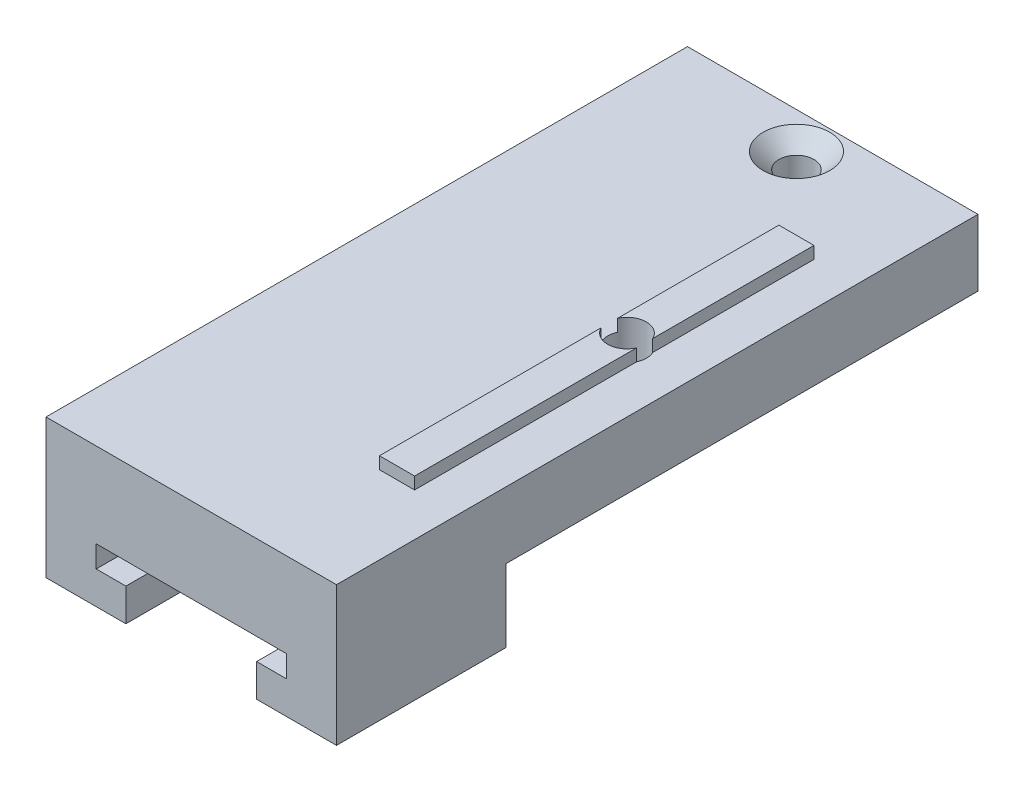
ISO-10303-21;
HEADER;
FILE_DESCRIPTION(('STEP AP214'),'2;1');
FILE_NAME('part.step','',(''),(''),'','','');
FILE_SCHEMA(('AUTOMOTIVE_DESIGN { 1 0 10303 214 1 1 1 1 }'));
ENDSEC;
DATA;
#1=APPLICATION_CONTEXT('core data for automotive mechanical design processes');
#2=APPLICATION_PROTOCOL_DEFINITION('international standard','automotive_design',2000,#1);
#3=PRODUCT_CONTEXT('',#1,'mechanical');
#4=PRODUCT('Part','Part','',(#3));
#5=PRODUCT_RELATED_PRODUCT_CATEGORY('part','',(#4));
#6=PRODUCT_DEFINITION_FORMATION('','',#4);
#7=PRODUCT_DEFINITION_CONTEXT('part definition',#1,'design');
#8=PRODUCT_DEFINITION('design','',#6,#7);
#9=PRODUCT_DEFINITION_SHAPE('','',#8);
#10=(LENGTH_UNIT() NAMED_UNIT(*) SI_UNIT(.MILLI.,.METRE.));
#11=(NAMED_UNIT(*) PLANE_ANGLE_UNIT() SI_UNIT($,.RADIAN.));
#12=(NAMED_UNIT(*) SI_UNIT($,.STERADIAN.) SOLID_ANGLE_UNIT());
#13=UNCERTAINTY_MEASURE_WITH_UNIT(LENGTH_MEASURE(1.E-05),#10,'distance_accuracy_value','');
#14=(GEOMETRIC_REPRESENTATION_CONTEXT(3) GLOBAL_UNCERTAINTY_ASSIGNED_CONTEXT((#13)) GLOBAL_UNIT_ASSIGNED_CONTEXT((#10,
#11,#12)) REPRESENTATION_CONTEXT('',''));
#15=CARTESIAN_POINT('',(0.,0.,0.));
#16=DIRECTION('',(0.,0.,1.));
#17=DIRECTION('',(1.,0.,0.));
#18=AXIS2_PLACEMENT_3D('',#15,#16,#17);
#19=CARTESIAN_POINT('',(-12.,6.,36.));
#20=DIRECTION('',(0.,0.,-1.));
#21=DIRECTION('',(-1.,0.,0.));
#22=AXIS2_PLACEMENT_3D('',#19,#20,#21);
#23=PLANE('',#22);
#24=DIRECTION('',(1.,0.,0.));
#25=VECTOR('',#24,1.);
#26=CARTESIAN_POINT('',(-12.,6.,36.));
#27=LINE('',#26,#25);
#28=CARTESIAN_POINT('',(-12.,6.,36.));
#29=VERTEX_POINT('',#28);
#30=CARTESIAN_POINT('',(-7.85,6.,36.));
#31=VERTEX_POINT('',#30);
#32=EDGE_CURVE('E315',#29,#31,#27,.T.);
#33=ORIENTED_EDGE('',*,*,#32,.T.);
#34=DIRECTION('',(0.,-1.,0.));
#35=VECTOR('',#34,1.);
#36=CARTESIAN_POINT('',(-7.85,4.5,36.));
#37=LINE('',#36,#35);
#38=CARTESIAN_POINT('',(-7.85,2.7,36.));
#39=VERTEX_POINT('',#38);
#40=EDGE_CURVE('E52',#31,#39,#37,.T.);
#41=ORIENTED_EDGE('',*,*,#40,.T.);
#42=DIRECTION('',(1.,0.,0.));
#43=VECTOR('',#42,1.);
#44=CARTESIAN_POINT('',(-7.85,2.7,36.));
#45=LINE('',#44,#43);
#46=CARTESIAN_POINT('',(-5.4,2.7,36.));
#47=VERTEX_POINT('',#46);
#48=EDGE_CURVE('E330',#39,#47,#45,.T.);
#49=ORIENTED_EDGE('',*,*,#48,.T.);
#50=DIRECTION('',(0.,-1.,0.));
#51=VECTOR('',#50,1.);
#52=CARTESIAN_POINT('',(-5.4,2.7,36.));
#53=LINE('',#52,#51);
#54=CARTESIAN_POINT('',(-5.4,0.,36.));
#55=VERTEX_POINT('',#54);
#56=EDGE_CURVE('E332',#47,#55,#53,.T.);
#57=ORIENTED_EDGE('',*,*,#56,.T.);
#58=DIRECTION('',(1.,0.,0.));
#59=VECTOR('',#58,1.);
#60=CARTESIAN_POINT('',(-12.,0.,36.));
#61=LINE('',#60,#59);
#62=CARTESIAN_POINT('',(-12.,0.,36.));
#63=VERTEX_POINT('',#62);
#64=EDGE_CURVE('E311',#63,#55,#61,.T.);
#65=ORIENTED_EDGE('',*,*,#64,.F.);
#66=DIRECTION('',(0.,-1.,0.));
#67=VECTOR('',#66,1.);
#68=CARTESIAN_POINT('',(-12.,6.,36.));
#69=LINE('',#68,#67);
#70=EDGE_CURVE('E324',#29,#63,#69,.T.);
#71=ORIENTED_EDGE('',*,*,#70,.F.);
#72=EDGE_LOOP('',(#33,#41,#49,#57,#65,#71));
#73=FACE_BOUND('',#72,.T.);
#74=ADVANCED_FACE('F35',(#73),#23,.T.);
#75=CARTESIAN_POINT('',(7.,0.,24.));
#76=DIRECTION('',(0.,1.,0.));
#77=DIRECTION('',(0.,0.,1.));
#78=AXIS2_PLACEMENT_3D('',#75,#76,#77);
#79=CYLINDRICAL_SURFACE('',#78,1.6);
#80=CARTESIAN_POINT('',(7.,11.5,24.));
#81=DIRECTION('',(0.,-1.,0.));
#82=DIRECTION('',(0.,0.,-1.));
#83=AXIS2_PLACEMENT_3D('',#80,#81,#82);
#84=CIRCLE('',#83,1.6);
#85=CARTESIAN_POINT('',(8.45,11.5,23.3236125370766));
#86=VERTEX_POINT('',#85);
#87=CARTESIAN_POINT('',(8.45,11.5,24.6763874629234));
#88=VERTEX_POINT('',#87);
#89=EDGE_CURVE('E266',#86,#88,#84,.T.);
#90=ORIENTED_EDGE('',*,*,#89,.F.);
#91=DIRECTION('',(0.,1.,0.));
#92=VECTOR('',#91,1.);
#93=CARTESIAN_POINT('',(8.45,0.,23.3236125370766));
#94=LINE('',#93,#92);
#95=CARTESIAN_POINT('',(8.45,12.5,23.3236125370766));
#96=VERTEX_POINT('',#95);
#97=EDGE_CURVE('E60',#96,#86,#94,.F.);
#98=ORIENTED_EDGE('',*,*,#97,.F.);
#99=CARTESIAN_POINT('',(7.,12.5,24.));
#100=DIRECTION('',(0.,-1.,0.));
#101=DIRECTION('',(0.,0.,-1.));
#102=AXIS2_PLACEMENT_3D('',#99,#100,#101);
#103=CIRCLE('',#102,1.6);
#104=CARTESIAN_POINT('',(5.55,12.5,23.3236125370765));
#105=VERTEX_POINT('',#104);
#106=EDGE_CURVE('E44',#105,#96,#103,.T.);
#107=ORIENTED_EDGE('',*,*,#106,.F.);
#108=DIRECTION('',(0.,1.,0.));
#109=VECTOR('',#108,1.);
#110=CARTESIAN_POINT('',(5.55,0.,23.3236125370765));
#111=LINE('',#110,#109);
#112=CARTESIAN_POINT('',(5.55,11.5,23.3236125370765));
#113=VERTEX_POINT('',#112);
#114=EDGE_CURVE('E265',#113,#105,#111,.T.);
#115=ORIENTED_EDGE('',*,*,#114,.F.);
#116=CARTESIAN_POINT('',(5.55,11.5,24.6763874629235));
#117=VERTEX_POINT('',#116);
#118=EDGE_CURVE('E250',#117,#113,#84,.T.);
#119=ORIENTED_EDGE('',*,*,#118,.F.);
#120=DIRECTION('',(0.,1.,0.));
#121=VECTOR('',#120,1.);
#122=CARTESIAN_POINT('',(5.55,0.,24.6763874629235));
#123=LINE('',#122,#121);
#124=CARTESIAN_POINT('',(5.55,12.5,24.6763874629235));
#125=VERTEX_POINT('',#124);
#126=EDGE_CURVE('E245',#125,#117,#123,.F.);
#127=ORIENTED_EDGE('',*,*,#126,.F.);
#128=CARTESIAN_POINT('',(8.45,12.5,24.6763874629234));
#129=VERTEX_POINT('',#128);
#130=EDGE_CURVE('E11',#129,#125,#103,.T.);
#131=ORIENTED_EDGE('',*,*,#130,.F.);
#132=DIRECTION('',(0.,1.,0.));
#133=VECTOR('',#132,1.);
#134=CARTESIAN_POINT('',(8.45,0.,24.6763874629234));
#135=LINE('',#134,#133);
#136=EDGE_CURVE('E270',#88,#129,#135,.T.);
#137=ORIENTED_EDGE('',*,*,#136,.F.);
#138=EDGE_LOOP('',(#90,#98,#107,#115,#119,#127,#131,#137));
#139=FACE_BOUND('',#138,.T.);
#140=CARTESIAN_POINT('',(7.,9.,24.));
#141=DIRECTION('',(0.,-1.,0.));
#142=DIRECTION('',(0.,0.,-1.));
#143=AXIS2_PLACEMENT_3D('',#140,#141,#142);
#144=CIRCLE('',#143,1.6);
#145=CARTESIAN_POINT('',(7.,9.,22.4));
#146=VERTEX_POINT('',#145);
#147=EDGE_CURVE('E243',#146,#146,#144,.F.);
#148=ORIENTED_EDGE('',*,*,#147,.F.);
#149=EDGE_LOOP('',(#148));
#150=FACE_BOUND('',#149,.T.);
#151=ADVANCED_FACE('F466',(#139,#150),#79,.F.);
#152=CARTESIAN_POINT('',(8.45,12.5,10.));
#153=DIRECTION('',(-1.,0.,0.));
#154=DIRECTION('',(0.,0.,1.));
#155=AXIS2_PLACEMENT_3D('',#152,#153,#154);
#156=PLANE('',#155);
#157=DIRECTION('',(0.,0.,-1.));
#158=VECTOR('',#157,1.);
#159=CARTESIAN_POINT('',(8.45,11.5,10.));
#160=LINE('',#159,#158);
#161=CARTESIAN_POINT('',(8.45,11.5,43.));
#162=VERTEX_POINT('',#161);
#163=EDGE_CURVE('E287',#162,#88,#160,.T.);
#164=ORIENTED_EDGE('',*,*,#163,.T.);
#165=ORIENTED_EDGE('',*,*,#136,.T.);
#166=DIRECTION('',(0.,0.,-1.));
#167=VECTOR('',#166,1.);
#168=CARTESIAN_POINT('',(8.45,12.5,10.));
#169=LINE('',#168,#167);
#170=CARTESIAN_POINT('',(8.45,12.5,43.));
#171=VERTEX_POINT('',#170);
#172=EDGE_CURVE('E274',#171,#129,#169,.T.);
#173=ORIENTED_EDGE('',*,*,#172,.F.);
#174=DIRECTION('',(0.,-1.,0.));
#175=VECTOR('',#174,1.);
#176=CARTESIAN_POINT('',(8.45,12.5,43.));
#177=LINE('',#176,#175);
#178=EDGE_CURVE('E286',#171,#162,#177,.T.);
#179=ORIENTED_EDGE('',*,*,#178,.T.);
#180=EDGE_LOOP('',(#164,#165,#173,#179));
#181=FACE_BOUND('',#180,.T.);
#182=ADVANCED_FACE('F471',(#181),#156,.F.);
#183=CARTESIAN_POINT('',(5.55,12.5,10.));
#184=DIRECTION('',(1.,0.,0.));
#185=DIRECTION('',(0.,0.,-1.));
#186=AXIS2_PLACEMENT_3D('',#183,#184,#185);
#187=PLANE('',#186);
#188=DIRECTION('',(0.,0.,1.));
#189=VECTOR('',#188,1.);
#190=CARTESIAN_POINT('',(5.55,11.5,10.));
#191=LINE('',#190,#189);
#192=CARTESIAN_POINT('',(5.55,11.5,10.));
#193=VERTEX_POINT('',#192);
#194=EDGE_CURVE('E294',#193,#113,#191,.T.);
#195=ORIENTED_EDGE('',*,*,#194,.T.);
#196=ORIENTED_EDGE('',*,*,#114,.T.);
#197=DIRECTION('',(0.,0.,1.));
#198=VECTOR('',#197,1.);
#199=CARTESIAN_POINT('',(5.55,12.5,10.));
#200=LINE('',#199,#198);
#201=CARTESIAN_POINT('',(5.55,12.5,10.));
#202=VERTEX_POINT('',#201);
#203=EDGE_CURVE('E281',#202,#105,#200,.T.);
#204=ORIENTED_EDGE('',*,*,#203,.F.);
#205=DIRECTION('',(0.,-1.,0.));
#206=VECTOR('',#205,1.);
#207=CARTESIAN_POINT('',(5.55,12.5,10.));
#208=LINE('',#207,#206);
#209=EDGE_CURVE('E305',#202,#193,#208,.T.);
#210=ORIENTED_EDGE('',*,*,#209,.T.);
#211=EDGE_LOOP('',(#195,#196,#204,#210));
#212=FACE_BOUND('',#211,.T.);
#213=ADVANCED_FACE('F550',(#212),#187,.F.);
#214=CARTESIAN_POINT('',(0.,12.5,0.));
#215=DIRECTION('',(0.,-1.,0.));
#216=DIRECTION('',(0.,0.,-1.));
#217=AXIS2_PLACEMENT_3D('',#214,#215,#216);
#218=PLANE('',#217);
#219=ORIENTED_EDGE('',*,*,#172,.T.);
#220=ORIENTED_EDGE('',*,*,#130,.T.);
#221=CARTESIAN_POINT('',(5.55,12.5,43.));
#222=VERTEX_POINT('',#221);
#223=EDGE_CURVE('E280',#125,#222,#200,.T.);
#224=ORIENTED_EDGE('',*,*,#223,.T.);
#225=DIRECTION('',(1.,0.,0.));
#226=VECTOR('',#225,1.);
#227=CARTESIAN_POINT('',(8.45,12.5,43.));
#228=LINE('',#227,#226);
#229=EDGE_CURVE('E284',#222,#171,#228,.T.);
#230=ORIENTED_EDGE('',*,*,#229,.T.);
#231=EDGE_LOOP('',(#219,#220,#224,#230));
#232=FACE_BOUND('',#231,.T.);
#233=ADVANCED_FACE('F486',(#232),#218,.F.);
#234=CARTESIAN_POINT('',(-12.,11.5,53.));
#235=DIRECTION('',(0.,-1.,0.));
#236=DIRECTION('',(0.,0.,-1.));
#237=AXIS2_PLACEMENT_3D('',#234,#235,#236);
#238=PLANE('',#237);
#239=CARTESIAN_POINT('',(0.,11.5,3.));
#240=DIRECTION('',(0.,1.,0.));
#241=DIRECTION('',(0.,0.,1.));
#242=AXIS2_PLACEMENT_3D('',#239,#240,#241);
#243=CIRCLE('',#242,2.75);
#244=CARTESIAN_POINT('',(0.,11.5,5.75));
#245=VERTEX_POINT('',#244);
#246=EDGE_CURVE('E404',#245,#245,#243,.T.);
#247=ORIENTED_EDGE('',*,*,#246,.F.);
#248=EDGE_LOOP('',(#247));
#249=FACE_BOUND('',#248,.T.);
#250=DIRECTION('',(-1.,0.,0.));
#251=VECTOR('',#250,1.);
#252=CARTESIAN_POINT('',(-12.,11.5,0.));
#253=LINE('',#252,#251);
#254=CARTESIAN_POINT('',(12.,11.5,0.));
#255=VERTEX_POINT('',#254);
#256=CARTESIAN_POINT('',(-12.,11.5,0.));
#257=VERTEX_POINT('',#256);
#258=EDGE_CURVE('E362',#255,#257,#253,.T.);
#259=ORIENTED_EDGE('',*,*,#258,.T.);
#260=DIRECTION('',(0.,0.,-1.));
#261=VECTOR('',#260,1.);
#262=CARTESIAN_POINT('',(-12.,11.5,53.));
#263=LINE('',#262,#261);
#264=CARTESIAN_POINT('',(-12.,11.5,53.));
#265=VERTEX_POINT('',#264);
#266=EDGE_CURVE('E371',#265,#257,#263,.T.);
#267=ORIENTED_EDGE('',*,*,#266,.F.);
#268=DIRECTION('',(-1.,0.,0.));
#269=VECTOR('',#268,1.);
#270=CARTESIAN_POINT('',(-12.,11.5,53.));
#271=LINE('',#270,#269);
#272=CARTESIAN_POINT('',(12.,11.5,53.));
#273=VERTEX_POINT('',#272);
#274=EDGE_CURVE('E354',#273,#265,#271,.T.);
#275=ORIENTED_EDGE('',*,*,#274,.F.);
#276=DIRECTION('',(0.,0.,-1.));
#277=VECTOR('',#276,1.);
#278=CARTESIAN_POINT('',(12.,11.5,53.));
#279=LINE('',#278,#277);
#280=EDGE_CURVE('E227',#273,#255,#279,.T.);
#281=ORIENTED_EDGE('',*,*,#280,.T.);
#282=EDGE_LOOP('',(#259,#267,#275,#281));
#283=FACE_BOUND('',#282,.T.);
#284=CARTESIAN_POINT('',(8.45,11.5,10.));
#285=VERTEX_POINT('',#284);
#286=EDGE_CURVE('E273',#86,#285,#160,.T.);
#287=ORIENTED_EDGE('',*,*,#286,.F.);
#288=ORIENTED_EDGE('',*,*,#89,.T.);
#289=ORIENTED_EDGE('',*,*,#163,.F.);
#290=DIRECTION('',(1.,0.,0.));
#291=VECTOR('',#290,1.);
#292=CARTESIAN_POINT('',(8.45,11.5,43.));
#293=LINE('',#292,#291);
#294=CARTESIAN_POINT('',(5.55000000000001,11.5,43.));
#295=VERTEX_POINT('',#294);
#296=EDGE_CURVE('E297',#295,#162,#293,.T.);
#297=ORIENTED_EDGE('',*,*,#296,.F.);
#298=EDGE_CURVE('E293',#117,#295,#191,.T.);
#299=ORIENTED_EDGE('',*,*,#298,.F.);
#300=ORIENTED_EDGE('',*,*,#118,.T.);
#301=ORIENTED_EDGE('',*,*,#194,.F.);
#302=DIRECTION('',(-1.,0.,0.));
#303=VECTOR('',#302,1.);
#304=CARTESIAN_POINT('',(8.45,11.5,10.));
#305=LINE('',#304,#303);
#306=EDGE_CURVE('E290',#285,#193,#305,.T.);
#307=ORIENTED_EDGE('',*,*,#306,.F.);
#308=EDGE_LOOP('',(#287,#288,#289,#297,#299,#300,#301,#307));
#309=FACE_BOUND('',#308,.T.);
#310=ADVANCED_FACE('F378',(#249,#283,#309),#238,.F.);
#311=CARTESIAN_POINT('',(-5.4,2.7,53.));
#312=DIRECTION('',(-1.,0.,0.));
#313=DIRECTION('',(0.,-1.,0.));
#314=AXIS2_PLACEMENT_3D('',#311,#312,#313);
#315=PLANE('',#314);
#316=ORIENTED_EDGE('',*,*,#56,.F.);
#317=DIRECTION('',(0.,0.,-1.));
#318=VECTOR('',#317,1.);
#319=CARTESIAN_POINT('',(-5.4,2.7,53.));
#320=LINE('',#319,#318);
#321=CARTESIAN_POINT('',(-5.4,2.7,53.));
#322=VERTEX_POINT('',#321);
#323=EDGE_CURVE('E241',#322,#47,#320,.T.);
#324=ORIENTED_EDGE('',*,*,#323,.F.);
#325=DIRECTION('',(0.,1.,0.));
#326=VECTOR('',#325,1.);
#327=CARTESIAN_POINT('',(-5.4,2.7,53.));
#328=LINE('',#327,#326);
#329=CARTESIAN_POINT('',(-5.4,0.,53.));
#330=VERTEX_POINT('',#329);
#331=EDGE_CURVE('E335',#330,#322,#328,.T.);
#332=ORIENTED_EDGE('',*,*,#331,.F.);
#333=DIRECTION('',(0.,0.,-1.));
#334=VECTOR('',#333,1.);
#335=CARTESIAN_POINT('',(-5.4,0.,53.));
#336=LINE('',#335,#334);
#337=EDGE_CURVE('E360',#330,#55,#336,.T.);
#338=ORIENTED_EDGE('',*,*,#337,.T.);
#339=EDGE_LOOP('',(#316,#324,#332,#338));
#340=FACE_BOUND('',#339,.T.);
#341=ADVANCED_FACE('F37',(#340),#315,.F.);
#342=CARTESIAN_POINT('',(-7.85,2.7,53.));
#343=DIRECTION('',(0.,-1.,0.));
#344=DIRECTION('',(0.,0.,-1.));
#345=AXIS2_PLACEMENT_3D('',#342,#343,#344);
#346=PLANE('',#345);
#347=ORIENTED_EDGE('',*,*,#48,.F.);
#348=DIRECTION('',(0.,0.,-1.));
#349=VECTOR('',#348,1.);
#350=CARTESIAN_POINT('',(-7.85,2.7,53.));
#351=LINE('',#350,#349);
#352=CARTESIAN_POINT('',(-7.85,2.7,53.));
#353=VERTEX_POINT('',#352);
#354=EDGE_CURVE('E239',#353,#39,#351,.T.);
#355=ORIENTED_EDGE('',*,*,#354,.F.);
#356=DIRECTION('',(-1.,0.,0.));
#357=VECTOR('',#356,1.);
#358=CARTESIAN_POINT('',(-7.85,2.7,53.));
#359=LINE('',#358,#357);
#360=EDGE_CURVE('E338',#322,#353,#359,.T.);
#361=ORIENTED_EDGE('',*,*,#360,.F.);
#362=ORIENTED_EDGE('',*,*,#323,.T.);
#363=EDGE_LOOP('',(#347,#355,#361,#362));
#364=FACE_BOUND('',#363,.T.);
#365=ADVANCED_FACE('F438',(#364),#346,.F.);
#366=CARTESIAN_POINT('',(-7.85,4.5,53.));
#367=DIRECTION('',(-1.,0.,0.));
#368=DIRECTION('',(0.,-1.,0.));
#369=AXIS2_PLACEMENT_3D('',#366,#367,#368);
#370=PLANE('',#369);
#371=ORIENTED_EDGE('',*,*,#40,.F.);
#372=DIRECTION('',(0.,0.,-1.));
#373=VECTOR('',#372,1.);
#374=CARTESIAN_POINT('',(-7.85,6.,36.));
#375=LINE('',#374,#373);
#376=CARTESIAN_POINT('',(-7.85,6.,44.5));
#377=VERTEX_POINT('',#376);
#378=EDGE_CURVE('E419',#377,#31,#375,.T.);
#379=ORIENTED_EDGE('',*,*,#378,.F.);
#380=DIRECTION('',(0.,-1.,0.));
#381=VECTOR('',#380,1.);
#382=CARTESIAN_POINT('',(-7.85,23.8532910131438,44.5));
#383=LINE('',#382,#381);
#384=CARTESIAN_POINT('',(-7.85,4.5,44.5));
#385=VERTEX_POINT('',#384);
#386=EDGE_CURVE('E416',#377,#385,#383,.T.);
#387=ORIENTED_EDGE('',*,*,#386,.T.);
#388=DIRECTION('',(0.,0.,-1.));
#389=VECTOR('',#388,1.);
#390=CARTESIAN_POINT('',(-7.85,4.5,53.));
#391=LINE('',#390,#389);
#392=CARTESIAN_POINT('',(-7.85,4.5,53.));
#393=VERTEX_POINT('',#392);
#394=EDGE_CURVE('E236',#393,#385,#391,.T.);
#395=ORIENTED_EDGE('',*,*,#394,.F.);
#396=DIRECTION('',(0.,1.,0.));
#397=VECTOR('',#396,1.);
#398=CARTESIAN_POINT('',(-7.85,4.5,53.));
#399=LINE('',#398,#397);
#400=EDGE_CURVE('E341',#353,#393,#399,.T.);
#401=ORIENTED_EDGE('',*,*,#400,.F.);
#402=ORIENTED_EDGE('',*,*,#354,.T.);
#403=EDGE_LOOP('',(#371,#379,#387,#395,#401,#402));
#404=FACE_BOUND('',#403,.T.);
#405=ADVANCED_FACE('F422',(#404),#370,.F.);
#406=CARTESIAN_POINT('',(7.85,4.5,53.));
#407=DIRECTION('',(0.,1.,0.));
#408=DIRECTION('',(-1.,0.,0.));
#409=AXIS2_PLACEMENT_3D('',#406,#407,#408);
#410=PLANE('',#409);
#411=ORIENTED_EDGE('',*,*,#394,.T.);
#412=DIRECTION('',(-1.,0.,0.));
#413=VECTOR('',#412,1.);
#414=CARTESIAN_POINT('',(7.85,4.5,44.5));
#415=LINE('',#414,#413);
#416=CARTESIAN_POINT('',(7.85,4.5,44.5));
#417=VERTEX_POINT('',#416);
#418=EDGE_CURVE('E410',#417,#385,#415,.T.);
#419=ORIENTED_EDGE('',*,*,#418,.F.);
#420=DIRECTION('',(0.,0.,-1.));
#421=VECTOR('',#420,1.);
#422=CARTESIAN_POINT('',(7.85,4.5,53.));
#423=LINE('',#422,#421);
#424=CARTESIAN_POINT('',(7.85,4.5,53.));
#425=VERTEX_POINT('',#424);
#426=EDGE_CURVE('E233',#425,#417,#423,.T.);
#427=ORIENTED_EDGE('',*,*,#426,.F.);
#428=DIRECTION('',(1.,0.,0.));
#429=VECTOR('',#428,1.);
#430=CARTESIAN_POINT('',(7.85,4.5,53.));
#431=LINE('',#430,#429);
#432=EDGE_CURVE('E343',#393,#425,#431,.T.);
#433=ORIENTED_EDGE('',*,*,#432,.F.);
#434=EDGE_LOOP('',(#411,#419,#427,#433));
#435=FACE_BOUND('',#434,.T.);
#436=ADVANCED_FACE('F432',(#435),#410,.F.);
#437=CARTESIAN_POINT('',(7.85,2.7,53.));
#438=DIRECTION('',(1.,0.,0.));
#439=DIRECTION('',(0.,0.,-1.));
#440=AXIS2_PLACEMENT_3D('',#437,#438,#439);
#441=PLANE('',#440);
#442=DIRECTION('',(0.,0.,1.));
#443=VECTOR('',#442,1.);
#444=CARTESIAN_POINT('',(7.85,6.,36.));
#445=LINE('',#444,#443);
#446=CARTESIAN_POINT('',(7.85,6.,39.));
#447=VERTEX_POINT('',#446);
#448=CARTESIAN_POINT('',(7.85,6.,44.5));
#449=VERTEX_POINT('',#448);
#450=EDGE_CURVE('E417',#447,#449,#445,.T.);
#451=ORIENTED_EDGE('',*,*,#450,.F.);
#452=DIRECTION('',(0.,-1.,0.));
#453=VECTOR('',#452,1.);
#454=CARTESIAN_POINT('',(7.85,2.7,39.));
#455=LINE('',#454,#453);
#456=CARTESIAN_POINT('',(7.85,2.7,39.));
#457=VERTEX_POINT('',#456);
#458=EDGE_CURVE('E398',#447,#457,#455,.T.);
#459=ORIENTED_EDGE('',*,*,#458,.T.);
#460=DIRECTION('',(0.,0.,-1.));
#461=VECTOR('',#460,1.);
#462=CARTESIAN_POINT('',(7.85,2.7,53.));
#463=LINE('',#462,#461);
#464=CARTESIAN_POINT('',(7.85,2.7,53.));
#465=VERTEX_POINT('',#464);
#466=EDGE_CURVE('E225',#465,#457,#463,.T.);
#467=ORIENTED_EDGE('',*,*,#466,.F.);
#468=DIRECTION('',(0.,-1.,0.));
#469=VECTOR('',#468,1.);
#470=CARTESIAN_POINT('',(7.85,2.7,53.));
#471=LINE('',#470,#469);
#472=EDGE_CURVE('E345',#425,#465,#471,.T.);
#473=ORIENTED_EDGE('',*,*,#472,.F.);
#474=ORIENTED_EDGE('',*,*,#426,.T.);
#475=DIRECTION('',(0.,-1.,0.));
#476=VECTOR('',#475,1.);
#477=CARTESIAN_POINT('',(7.85,23.8532910131438,44.5));
#478=LINE('',#477,#476);
#479=EDGE_CURVE('E258',#449,#417,#478,.T.);
#480=ORIENTED_EDGE('',*,*,#479,.F.);
#481=EDGE_LOOP('',(#451,#459,#467,#473,#474,#480));
#482=FACE_BOUND('',#481,.T.);
#483=ADVANCED_FACE('F453',(#482),#441,.F.);
#484=CARTESIAN_POINT('',(5.4,2.7,53.));
#485=DIRECTION('',(0.,-1.,0.));
#486=DIRECTION('',(0.,0.,-1.));
#487=AXIS2_PLACEMENT_3D('',#484,#485,#486);
#488=PLANE('',#487);
#489=ORIENTED_EDGE('',*,*,#466,.T.);
#490=DIRECTION('',(-1.,0.,0.));
#491=VECTOR('',#490,1.);
#492=CARTESIAN_POINT('',(5.4,2.7,39.));
#493=LINE('',#492,#491);
#494=CARTESIAN_POINT('',(5.4,2.7,39.));
#495=VERTEX_POINT('',#494);
#496=EDGE_CURVE('E396',#457,#495,#493,.T.);
#497=ORIENTED_EDGE('',*,*,#496,.T.);
#498=DIRECTION('',(0.,0.,-1.));
#499=VECTOR('',#498,1.);
#500=CARTESIAN_POINT('',(5.4,2.7,53.));
#501=LINE('',#500,#499);
#502=CARTESIAN_POINT('',(5.4,2.7,53.));
#503=VERTEX_POINT('',#502);
#504=EDGE_CURVE('E219',#503,#495,#501,.T.);
#505=ORIENTED_EDGE('',*,*,#504,.F.);
#506=DIRECTION('',(-1.,0.,0.));
#507=VECTOR('',#506,1.);
#508=CARTESIAN_POINT('',(5.4,2.7,53.));
#509=LINE('',#508,#507);
#510=EDGE_CURVE('E347',#465,#503,#509,.T.);
#511=ORIENTED_EDGE('',*,*,#510,.F.);
#512=EDGE_LOOP('',(#489,#497,#505,#511));
#513=FACE_BOUND('',#512,.T.);
#514=ADVANCED_FACE('F456',(#513),#488,.F.);
#515=CARTESIAN_POINT('',(5.4,0.,53.));
#516=DIRECTION('',(1.,0.,0.));
#517=DIRECTION('',(0.,1.,0.));
#518=AXIS2_PLACEMENT_3D('',#515,#516,#517);
#519=PLANE('',#518);
#520=ORIENTED_EDGE('',*,*,#504,.T.);
#521=DIRECTION('',(0.,-1.,0.));
#522=VECTOR('',#521,1.);
#523=CARTESIAN_POINT('',(5.4,13.2498275841567,39.));
#524=LINE('',#523,#522);
#525=CARTESIAN_POINT('',(5.4,0.,39.));
#526=VERTEX_POINT('',#525);
#527=EDGE_CURVE('E201',#495,#526,#524,.T.);
#528=ORIENTED_EDGE('',*,*,#527,.T.);
#529=DIRECTION('',(0.,0.,-1.));
#530=VECTOR('',#529,1.);
#531=CARTESIAN_POINT('',(5.4,0.,53.));
#532=LINE('',#531,#530);
#533=CARTESIAN_POINT('',(5.4,0.,53.));
#534=VERTEX_POINT('',#533);
#535=EDGE_CURVE('E216',#534,#526,#532,.T.);
#536=ORIENTED_EDGE('',*,*,#535,.F.);
#537=DIRECTION('',(0.,-1.,0.));
#538=VECTOR('',#537,1.);
#539=CARTESIAN_POINT('',(5.4,0.,53.));
#540=LINE('',#539,#538);
#541=EDGE_CURVE('E349',#503,#534,#540,.T.);
#542=ORIENTED_EDGE('',*,*,#541,.F.);
#543=EDGE_LOOP('',(#520,#528,#536,#542));
#544=FACE_BOUND('',#543,.T.);
#545=ADVANCED_FACE('F214',(#544),#519,.F.);
#546=CARTESIAN_POINT('',(12.,0.,53.));
#547=DIRECTION('',(0.,1.,0.));
#548=DIRECTION('',(0.,0.,1.));
#549=AXIS2_PLACEMENT_3D('',#546,#547,#548);
#550=PLANE('',#549);
#551=ORIENTED_EDGE('',*,*,#535,.T.);
#552=DIRECTION('',(-1.,0.,0.));
#553=VECTOR('',#552,1.);
#554=CARTESIAN_POINT('',(12.,0.,39.));
#555=LINE('',#554,#553);
#556=CARTESIAN_POINT('',(12.,0.,39.));
#557=VERTEX_POINT('',#556);
#558=EDGE_CURVE('E197',#557,#526,#555,.T.);
#559=ORIENTED_EDGE('',*,*,#558,.F.);
#560=DIRECTION('',(0.,0.,-1.));
#561=VECTOR('',#560,1.);
#562=CARTESIAN_POINT('',(12.,0.,53.));
#563=LINE('',#562,#561);
#564=CARTESIAN_POINT('',(12.,0.,53.));
#565=VERTEX_POINT('',#564);
#566=EDGE_CURVE('E223',#565,#557,#563,.T.);
#567=ORIENTED_EDGE('',*,*,#566,.F.);
#568=DIRECTION('',(1.,0.,0.));
#569=VECTOR('',#568,1.);
#570=CARTESIAN_POINT('',(12.,0.,53.));
#571=LINE('',#570,#569);
#572=EDGE_CURVE('E222',#534,#565,#571,.T.);
#573=ORIENTED_EDGE('',*,*,#572,.F.);
#574=EDGE_LOOP('',(#551,#559,#567,#573));
#575=FACE_BOUND('',#574,.T.);
#576=ADVANCED_FACE('F221',(#575),#550,.F.);
#577=CARTESIAN_POINT('',(12.,11.5,53.));
#578=DIRECTION('',(-1.,0.,0.));
#579=DIRECTION('',(0.,-1.,0.));
#580=AXIS2_PLACEMENT_3D('',#577,#578,#579);
#581=PLANE('',#580);
#582=DIRECTION('',(0.,-1.,0.));
#583=VECTOR('',#582,1.);
#584=CARTESIAN_POINT('',(12.,13.2498275841567,39.));
#585=LINE('',#584,#583);
#586=CARTESIAN_POINT('',(12.,6.,39.));
#587=VERTEX_POINT('',#586);
#588=EDGE_CURVE('E204',#587,#557,#585,.T.);
#589=ORIENTED_EDGE('',*,*,#588,.F.);
#590=DIRECTION('',(0.,0.,-1.));
#591=VECTOR('',#590,1.);
#592=CARTESIAN_POINT('',(12.,6.,0.));
#593=LINE('',#592,#591);
#594=CARTESIAN_POINT('',(12.,6.,0.));
#595=VERTEX_POINT('',#594);
#596=EDGE_CURVE('E318',#587,#595,#593,.T.);
#597=ORIENTED_EDGE('',*,*,#596,.T.);
#598=DIRECTION('',(0.,1.,0.));
#599=VECTOR('',#598,1.);
#600=CARTESIAN_POINT('',(12.,11.5,0.));
#601=LINE('',#600,#599);
#602=EDGE_CURVE('E334',#595,#255,#601,.T.);
#603=ORIENTED_EDGE('',*,*,#602,.T.);
#604=ORIENTED_EDGE('',*,*,#280,.F.);
#605=DIRECTION('',(0.,1.,0.));
#606=VECTOR('',#605,1.);
#607=CARTESIAN_POINT('',(12.,11.5,53.));
#608=LINE('',#607,#606);
#609=EDGE_CURVE('E352',#565,#273,#608,.T.);
#610=ORIENTED_EDGE('',*,*,#609,.F.);
#611=ORIENTED_EDGE('',*,*,#566,.T.);
#612=EDGE_LOOP('',(#589,#597,#603,#604,#610,#611));
#613=FACE_BOUND('',#612,.T.);
#614=ADVANCED_FACE('F395',(#613),#581,.F.);
#615=CARTESIAN_POINT('',(-12.,11.5,53.));
#616=DIRECTION('',(1.,0.,0.));
#617=DIRECTION('',(0.,1.,0.));
#618=AXIS2_PLACEMENT_3D('',#615,#616,#617);
#619=PLANE('',#618);
#620=ORIENTED_EDGE('',*,*,#70,.T.);
#621=DIRECTION('',(0.,0.,-1.));
#622=VECTOR('',#621,1.);
#623=CARTESIAN_POINT('',(-12.,0.,53.));
#624=LINE('',#623,#622);
#625=CARTESIAN_POINT('',(-12.,0.,53.));
#626=VERTEX_POINT('',#625);
#627=EDGE_CURVE('E368',#626,#63,#624,.T.);
#628=ORIENTED_EDGE('',*,*,#627,.F.);
#629=DIRECTION('',(0.,-1.,0.));
#630=VECTOR('',#629,1.);
#631=CARTESIAN_POINT('',(-12.,11.5,53.));
#632=LINE('',#631,#630);
#633=EDGE_CURVE('E356',#265,#626,#632,.T.);
#634=ORIENTED_EDGE('',*,*,#633,.F.);
#635=ORIENTED_EDGE('',*,*,#266,.T.);
#636=DIRECTION('',(0.,-1.,0.));
#637=VECTOR('',#636,1.);
#638=CARTESIAN_POINT('',(-12.,11.5,0.));
#639=LINE('',#638,#637);
#640=CARTESIAN_POINT('',(-12.,6.,0.));
#641=VERTEX_POINT('',#640);
#642=EDGE_CURVE('E339',#257,#641,#639,.T.);
#643=ORIENTED_EDGE('',*,*,#642,.T.);
#644=DIRECTION('',(0.,0.,1.));
#645=VECTOR('',#644,1.);
#646=CARTESIAN_POINT('',(-12.,6.,0.));
#647=LINE('',#646,#645);
#648=EDGE_CURVE('E312',#641,#29,#647,.T.);
#649=ORIENTED_EDGE('',*,*,#648,.T.);
#650=EDGE_LOOP('',(#620,#628,#634,#635,#643,#649));
#651=FACE_BOUND('',#650,.T.);
#652=ADVANCED_FACE('F388',(#651),#619,.F.);
#653=CARTESIAN_POINT('',(-5.4,0.,53.));
#654=DIRECTION('',(0.,1.,0.));
#655=DIRECTION('',(0.,0.,1.));
#656=AXIS2_PLACEMENT_3D('',#653,#654,#655);
#657=PLANE('',#656);
#658=ORIENTED_EDGE('',*,*,#64,.T.);
#659=ORIENTED_EDGE('',*,*,#337,.F.);
#660=DIRECTION('',(1.,0.,0.));
#661=VECTOR('',#660,1.);
#662=CARTESIAN_POINT('',(-5.4,0.,53.));
#663=LINE('',#662,#661);
#664=EDGE_CURVE('E358',#626,#330,#663,.T.);
#665=ORIENTED_EDGE('',*,*,#664,.F.);
#666=ORIENTED_EDGE('',*,*,#627,.T.);
#667=EDGE_LOOP('',(#658,#659,#665,#666));
#668=FACE_BOUND('',#667,.T.);
#669=ADVANCED_FACE('F445',(#668),#657,.F.);
#670=CARTESIAN_POINT('',(0.,0.,53.));
#671=DIRECTION('',(0.,0.,-1.));
#672=DIRECTION('',(-1.,0.,0.));
#673=AXIS2_PLACEMENT_3D('',#670,#671,#672);
#674=PLANE('',#673);
#675=ORIENTED_EDGE('',*,*,#331,.T.);
#676=ORIENTED_EDGE('',*,*,#360,.T.);
#677=ORIENTED_EDGE('',*,*,#400,.T.);
#678=ORIENTED_EDGE('',*,*,#432,.T.);
#679=ORIENTED_EDGE('',*,*,#472,.T.);
#680=ORIENTED_EDGE('',*,*,#510,.T.);
#681=ORIENTED_EDGE('',*,*,#541,.T.);
#682=ORIENTED_EDGE('',*,*,#572,.T.);
#683=ORIENTED_EDGE('',*,*,#609,.T.);
#684=ORIENTED_EDGE('',*,*,#274,.T.);
#685=ORIENTED_EDGE('',*,*,#633,.T.);
#686=ORIENTED_EDGE('',*,*,#664,.T.);
#687=EDGE_LOOP('',(#675,#676,#677,#678,#679,#680,#681,#682,#683,#684,#685,#686));
#688=FACE_BOUND('',#687,.T.);
#689=ADVANCED_FACE('F393',(#688),#674,.F.);
#690=CARTESIAN_POINT('',(0.,0.,0.));
#691=DIRECTION('',(0.,0.,-1.));
#692=DIRECTION('',(-1.,0.,0.));
#693=AXIS2_PLACEMENT_3D('',#690,#691,#692);
#694=PLANE('',#693);
#695=DIRECTION('',(-1.,0.,0.));
#696=VECTOR('',#695,1.);
#697=CARTESIAN_POINT('',(-12.,6.,0.));
#698=LINE('',#697,#696);
#699=EDGE_CURVE('E321',#595,#641,#698,.T.);
#700=ORIENTED_EDGE('',*,*,#699,.T.);
#701=ORIENTED_EDGE('',*,*,#642,.F.);
#702=ORIENTED_EDGE('',*,*,#258,.F.);
#703=ORIENTED_EDGE('',*,*,#602,.F.);
#704=EDGE_LOOP('',(#700,#701,#702,#703));
#705=FACE_BOUND('',#704,.T.);
#706=ADVANCED_FACE('F386',(#705),#694,.T.);
#707=CARTESIAN_POINT('',(0.,6.,0.));
#708=DIRECTION('',(0.,1.,0.));
#709=DIRECTION('',(0.,0.,1.));
#710=AXIS2_PLACEMENT_3D('',#707,#708,#709);
#711=PLANE('',#710);
#712=DIRECTION('',(-1.,0.,0.));
#713=VECTOR('',#712,1.);
#714=CARTESIAN_POINT('',(12.,6.,39.));
#715=LINE('',#714,#713);
#716=EDGE_CURVE('E209',#587,#447,#715,.T.);
#717=ORIENTED_EDGE('',*,*,#716,.T.);
#718=ORIENTED_EDGE('',*,*,#450,.T.);
#719=DIRECTION('',(-1.,0.,0.));
#720=VECTOR('',#719,1.);
#721=CARTESIAN_POINT('',(7.85,6.,44.5));
#722=LINE('',#721,#720);
#723=EDGE_CURVE('E413',#449,#377,#722,.T.);
#724=ORIENTED_EDGE('',*,*,#723,.T.);
#725=ORIENTED_EDGE('',*,*,#378,.T.);
#726=ORIENTED_EDGE('',*,*,#32,.F.);
#727=ORIENTED_EDGE('',*,*,#648,.F.);
#728=ORIENTED_EDGE('',*,*,#699,.F.);
#729=ORIENTED_EDGE('',*,*,#596,.F.);
#730=EDGE_LOOP('',(#717,#718,#724,#725,#726,#727,#728,#729));
#731=FACE_BOUND('',#730,.T.);
#732=CARTESIAN_POINT('',(0.,6.,3.));
#733=DIRECTION('',(0.,1.,0.));
#734=DIRECTION('',(0.,0.,1.));
#735=AXIS2_PLACEMENT_3D('',#732,#733,#734);
#736=CIRCLE('',#735,1.44999999999999);
#737=CARTESIAN_POINT('',(0.,6.,4.44999999999999));
#738=VERTEX_POINT('',#737);
#739=EDGE_CURVE('E39',#738,#738,#736,.T.);
#740=ORIENTED_EDGE('',*,*,#739,.T.);
#741=EDGE_LOOP('',(#740));
#742=FACE_BOUND('',#741,.T.);
#743=CARTESIAN_POINT('',(7.,6.,24.));
#744=DIRECTION('',(0.,-1.,0.));
#745=DIRECTION('',(0.,0.,-1.));
#746=AXIS2_PLACEMENT_3D('',#743,#744,#745);
#747=CIRCLE('',#746,4.35);
#748=CARTESIAN_POINT('',(7.,6.,19.65));
#749=VERTEX_POINT('',#748);
#750=EDGE_CURVE('E253',#749,#749,#747,.T.);
#751=ORIENTED_EDGE('',*,*,#750,.F.);
#752=EDGE_LOOP('',(#751));
#753=FACE_BOUND('',#752,.T.);
#754=ADVANCED_FACE('F449',(#731,#742,#753),#711,.F.);
#755=CARTESIAN_POINT('',(8.45,12.5,10.));
#756=VERTEX_POINT('',#755);
#757=EDGE_CURVE('E278',#96,#756,#169,.T.);
#758=ORIENTED_EDGE('',*,*,#757,.F.);
#759=ORIENTED_EDGE('',*,*,#97,.T.);
#760=ORIENTED_EDGE('',*,*,#286,.T.);
#761=DIRECTION('',(0.,-1.,0.));
#762=VECTOR('',#761,1.);
#763=CARTESIAN_POINT('',(8.45,12.5,10.));
#764=LINE('',#763,#762);
#765=EDGE_CURVE('E308',#756,#285,#764,.T.);
#766=ORIENTED_EDGE('',*,*,#765,.F.);
#767=EDGE_LOOP('',(#758,#759,#760,#766));
#768=FACE_BOUND('',#767,.T.);
#769=ADVANCED_FACE('F524',(#768),#156,.F.);
#770=CARTESIAN_POINT('',(8.45,12.5,10.));
#771=DIRECTION('',(0.,0.,1.));
#772=DIRECTION('',(1.,0.,0.));
#773=AXIS2_PLACEMENT_3D('',#770,#771,#772);
#774=PLANE('',#773);
#775=ORIENTED_EDGE('',*,*,#306,.T.);
#776=ORIENTED_EDGE('',*,*,#209,.F.);
#777=DIRECTION('',(-1.,0.,0.));
#778=VECTOR('',#777,1.);
#779=CARTESIAN_POINT('',(8.45,12.5,10.));
#780=LINE('',#779,#778);
#781=EDGE_CURVE('E277',#756,#202,#780,.T.);
#782=ORIENTED_EDGE('',*,*,#781,.F.);
#783=ORIENTED_EDGE('',*,*,#765,.T.);
#784=EDGE_LOOP('',(#775,#776,#782,#783));
#785=FACE_BOUND('',#784,.T.);
#786=ADVANCED_FACE('F531',(#785),#774,.F.);
#787=ORIENTED_EDGE('',*,*,#223,.F.);
#788=ORIENTED_EDGE('',*,*,#126,.T.);
#789=ORIENTED_EDGE('',*,*,#298,.T.);
#790=DIRECTION('',(0.,-1.,0.));
#791=VECTOR('',#790,1.);
#792=CARTESIAN_POINT('',(5.55,12.5,43.));
#793=LINE('',#792,#791);
#794=EDGE_CURVE('E302',#222,#295,#793,.T.);
#795=ORIENTED_EDGE('',*,*,#794,.F.);
#796=EDGE_LOOP('',(#787,#788,#789,#795));
#797=FACE_BOUND('',#796,.T.);
#798=ADVANCED_FACE('F539',(#797),#187,.F.);
#799=CARTESIAN_POINT('',(8.45,12.5,43.));
#800=DIRECTION('',(0.,0.,-1.));
#801=DIRECTION('',(-1.,0.,0.));
#802=AXIS2_PLACEMENT_3D('',#799,#800,#801);
#803=PLANE('',#802);
#804=ORIENTED_EDGE('',*,*,#296,.T.);
#805=ORIENTED_EDGE('',*,*,#178,.F.);
#806=ORIENTED_EDGE('',*,*,#229,.F.);
#807=ORIENTED_EDGE('',*,*,#794,.T.);
#808=EDGE_LOOP('',(#804,#805,#806,#807));
#809=FACE_BOUND('',#808,.T.);
#810=ADVANCED_FACE('F547',(#809),#803,.F.);
#811=ORIENTED_EDGE('',*,*,#203,.T.);
#812=ORIENTED_EDGE('',*,*,#106,.T.);
#813=ORIENTED_EDGE('',*,*,#757,.T.);
#814=ORIENTED_EDGE('',*,*,#781,.T.);
#815=EDGE_LOOP('',(#811,#812,#813,#814));
#816=FACE_BOUND('',#815,.T.);
#817=ADVANCED_FACE('F556',(#816),#218,.F.);
#818=CARTESIAN_POINT('',(7.,9.,24.));
#819=DIRECTION('',(0.,-1.,0.));
#820=DIRECTION('',(0.,0.,-1.));
#821=AXIS2_PLACEMENT_3D('',#818,#819,#820);
#822=PLANE('',#821);
#823=CARTESIAN_POINT('',(7.,9.,24.));
#824=DIRECTION('',(0.,-1.,0.));
#825=DIRECTION('',(0.,0.,-1.));
#826=AXIS2_PLACEMENT_3D('',#823,#824,#825);
#827=CIRCLE('',#826,4.35);
#828=CARTESIAN_POINT('',(7.,9.,19.65));
#829=VERTEX_POINT('',#828);
#830=EDGE_CURVE('E246',#829,#829,#827,.T.);
#831=ORIENTED_EDGE('',*,*,#830,.T.);
#832=EDGE_LOOP('',(#831));
#833=FACE_BOUND('',#832,.T.);
#834=ORIENTED_EDGE('',*,*,#147,.T.);
#835=EDGE_LOOP('',(#834));
#836=FACE_BOUND('',#835,.T.);
#837=ADVANCED_FACE('F564',(#833,#836),#822,.T.);
#838=CARTESIAN_POINT('',(7.,9.,24.));
#839=DIRECTION('',(0.,-1.,0.));
#840=DIRECTION('',(0.,0.,-1.));
#841=AXIS2_PLACEMENT_3D('',#838,#839,#840);
#842=CYLINDRICAL_SURFACE('',#841,4.35);
#843=ORIENTED_EDGE('',*,*,#830,.F.);
#844=EDGE_LOOP('',(#843));
#845=FACE_BOUND('',#844,.T.);
#846=ORIENTED_EDGE('',*,*,#750,.T.);
#847=EDGE_LOOP('',(#846));
#848=FACE_BOUND('',#847,.T.);
#849=ADVANCED_FACE('F573',(#845,#848),#842,.F.);
#850=CARTESIAN_POINT('',(7.85,23.8532910131438,44.5));
#851=DIRECTION('',(0.,0.,1.));
#852=DIRECTION('',(1.,0.,0.));
#853=AXIS2_PLACEMENT_3D('',#850,#851,#852);
#854=PLANE('',#853);
#855=ORIENTED_EDGE('',*,*,#479,.T.);
#856=ORIENTED_EDGE('',*,*,#418,.T.);
#857=ORIENTED_EDGE('',*,*,#386,.F.);
#858=ORIENTED_EDGE('',*,*,#723,.F.);
#859=EDGE_LOOP('',(#855,#856,#857,#858));
#860=FACE_BOUND('',#859,.T.);
#861=ADVANCED_FACE('F428',(#860),#854,.F.);
#862=CARTESIAN_POINT('',(0.,11.5,3.));
#863=DIRECTION('',(0.,1.,0.));
#864=DIRECTION('',(0.,0.,1.));
#865=AXIS2_PLACEMENT_3D('',#862,#863,#864);
#866=CYLINDRICAL_SURFACE('',#865,1.44999999999999);
#867=CARTESIAN_POINT('',(0.,10.2,3.));
#868=DIRECTION('',(0.,1.,0.));
#869=DIRECTION('',(0.,0.,1.));
#870=AXIS2_PLACEMENT_3D('',#867,#868,#869);
#871=CIRCLE('',#870,1.44999999999999);
#872=CARTESIAN_POINT('',(0.,10.2,4.44999999999999));
#873=VERTEX_POINT('',#872);
#874=EDGE_CURVE('E407',#873,#873,#871,.T.);
#875=ORIENTED_EDGE('',*,*,#874,.T.);
#876=EDGE_LOOP('',(#875));
#877=FACE_BOUND('',#876,.T.);
#878=ORIENTED_EDGE('',*,*,#739,.F.);
#879=EDGE_LOOP('',(#878));
#880=FACE_BOUND('',#879,.T.);
#881=ADVANCED_FACE('F587',(#877,#880),#866,.F.);
#882=CARTESIAN_POINT('',(0.,11.5,3.));
#883=DIRECTION('',(0.,1.,0.));
#884=DIRECTION('',(0.,0.,1.));
#885=AXIS2_PLACEMENT_3D('',#882,#883,#884);
#886=CONICAL_SURFACE('',#885,2.75,0.785398163397448);
#887=ORIENTED_EDGE('',*,*,#874,.F.);
#888=EDGE_LOOP('',(#887));
#889=FACE_BOUND('',#888,.T.);
#890=ORIENTED_EDGE('',*,*,#246,.T.);
#891=EDGE_LOOP('',(#890));
#892=FACE_BOUND('',#891,.T.);
#893=ADVANCED_FACE('F596',(#889,#892),#886,.F.);
#894=CARTESIAN_POINT('',(12.,13.2498275841567,39.));
#895=DIRECTION('',(0.,0.,1.));
#896=DIRECTION('',(1.,0.,0.));
#897=AXIS2_PLACEMENT_3D('',#894,#895,#896);
#898=PLANE('',#897);
#899=ORIENTED_EDGE('',*,*,#716,.F.);
#900=ORIENTED_EDGE('',*,*,#588,.T.);
#901=ORIENTED_EDGE('',*,*,#558,.T.);
#902=ORIENTED_EDGE('',*,*,#527,.F.);
#903=ORIENTED_EDGE('',*,*,#496,.F.);
#904=ORIENTED_EDGE('',*,*,#458,.F.);
#905=EDGE_LOOP('',(#899,#900,#901,#902,#903,#904));
#906=FACE_BOUND('',#905,.T.);
#907=ADVANCED_FACE('F200',(#906),#898,.F.);
#908=CLOSED_SHELL('',(#74,#151,#182,#213,#233,#310,#341,#365,#405,#436,#483,#514,#545,#576,#614,
#652,#669,#689,#706,#754,#769,#786,#798,#810,#817,#837,#849,#861,#881,#893,#907));
#909=MANIFOLD_SOLID_BREP('B2',#908);
#910=ADVANCED_BREP_SHAPE_REPRESENTATION('',(#18,#909),#14);
#911=SHAPE_DEFINITION_REPRESENTATION(#9,#910);
ENDSEC;
END-ISO-10303-21;
